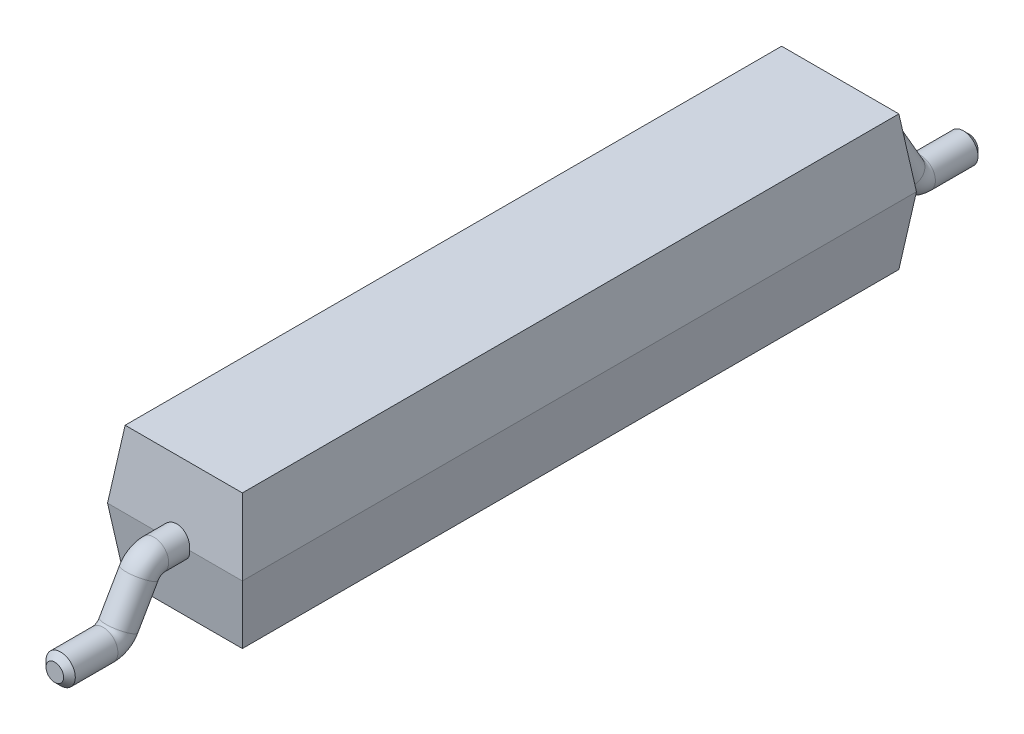
ISO-10303-21;
HEADER;
FILE_DESCRIPTION(('STEP AP214'),'2;1');
FILE_NAME('part.step','',(''),(''),'','','');
FILE_SCHEMA(('AUTOMOTIVE_DESIGN { 1 0 10303 214 1 1 1 1 }'));
ENDSEC;
DATA;
#1=APPLICATION_CONTEXT('core data for automotive mechanical design processes');
#2=APPLICATION_PROTOCOL_DEFINITION('international standard','automotive_design',2000,#1);
#3=PRODUCT_CONTEXT('',#1,'mechanical');
#4=PRODUCT('Part','Part','',(#3));
#5=PRODUCT_RELATED_PRODUCT_CATEGORY('part','',(#4));
#6=PRODUCT_DEFINITION_FORMATION('','',#4);
#7=PRODUCT_DEFINITION_CONTEXT('part definition',#1,'design');
#8=PRODUCT_DEFINITION('design','',#6,#7);
#9=PRODUCT_DEFINITION_SHAPE('','',#8);
#10=(LENGTH_UNIT() NAMED_UNIT(*) SI_UNIT(.MILLI.,.METRE.));
#11=(NAMED_UNIT(*) PLANE_ANGLE_UNIT() SI_UNIT($,.RADIAN.));
#12=(NAMED_UNIT(*) SI_UNIT($,.STERADIAN.) SOLID_ANGLE_UNIT());
#13=UNCERTAINTY_MEASURE_WITH_UNIT(LENGTH_MEASURE(1.E-05),#10,'distance_accuracy_value','');
#14=(GEOMETRIC_REPRESENTATION_CONTEXT(3) GLOBAL_UNCERTAINTY_ASSIGNED_CONTEXT((#13)) GLOBAL_UNIT_ASSIGNED_CONTEXT((#10,
#11,#12)) REPRESENTATION_CONTEXT('',''));
#15=CARTESIAN_POINT('',(0.,0.,0.));
#16=DIRECTION('',(0.,0.,1.));
#17=DIRECTION('',(1.,0.,0.));
#18=AXIS2_PLACEMENT_3D('',#15,#16,#17);
#19=CARTESIAN_POINT('',(-11.,1.15,5.75));
#20=DIRECTION('',(0.,-0.129339184067768,-0.991600411186222));
#21=DIRECTION('',(0.,0.991600411186222,-0.129339184067768));
#22=AXIS2_PLACEMENT_3D('',#19,#20,#21);
#23=PLANE('',#22);
#24=CARTESIAN_POINT('',(0.,1.15,5.75));
#25=DIRECTION('',(0.,-0.129339184067768,-0.991600411186222));
#26=DIRECTION('',(0.,0.991600411186222,-0.129339184067768));
#27=AXIS2_PLACEMENT_3D('',#24,#25,#26);
#28=ELLIPSE('',#27,0.252117684885722,0.25);
#29=CARTESIAN_POINT('',(0.249999999999995,1.15,5.75));
#30=VERTEX_POINT('',#29);
#31=CARTESIAN_POINT('',(-0.250000000000005,1.15,5.75));
#32=VERTEX_POINT('',#31);
#33=EDGE_CURVE('E238',#30,#32,#28,.F.);
#34=ORIENTED_EDGE('',*,*,#33,.F.);
#35=DIRECTION('',(1.,0.,0.));
#36=VECTOR('',#35,1.);
#37=CARTESIAN_POINT('',(-11.,1.15,5.75));
#38=LINE('',#37,#36);
#39=CARTESIAN_POINT('',(1.15,1.15,5.75));
#40=VERTEX_POINT('',#39);
#41=EDGE_CURVE('E237',#30,#40,#38,.T.);
#42=ORIENTED_EDGE('',*,*,#41,.T.);
#43=DIRECTION('',(0.128270737442704,-0.983408987060729,0.128270737442704));
#44=VECTOR('',#43,1.);
#45=CARTESIAN_POINT('',(1.15,1.15,5.75));
#46=LINE('',#45,#44);
#47=CARTESIAN_POINT('',(1.,2.3,5.6));
#48=VERTEX_POINT('',#47);
#49=EDGE_CURVE('E126',#48,#40,#46,.T.);
#50=ORIENTED_EDGE('',*,*,#49,.F.);
#51=DIRECTION('',(1.,0.,0.));
#52=VECTOR('',#51,1.);
#53=CARTESIAN_POINT('',(-11.,2.3,5.6));
#54=LINE('',#53,#52);
#55=CARTESIAN_POINT('',(-1.,2.3,5.6));
#56=VERTEX_POINT('',#55);
#57=EDGE_CURVE('E235',#56,#48,#54,.T.);
#58=ORIENTED_EDGE('',*,*,#57,.F.);
#59=DIRECTION('',(0.128270737442704,0.983408987060729,-0.128270737442704));
#60=VECTOR('',#59,1.);
#61=CARTESIAN_POINT('',(-1.00246800731261,2.28107861060329,5.60246800731261));
#62=LINE('',#61,#60);
#63=CARTESIAN_POINT('',(-1.15,1.15,5.75));
#64=VERTEX_POINT('',#63);
#65=EDGE_CURVE('E228',#64,#56,#62,.T.);
#66=ORIENTED_EDGE('',*,*,#65,.F.);
#67=EDGE_CURVE('E239',#64,#32,#38,.T.);
#68=ORIENTED_EDGE('',*,*,#67,.T.);
#69=EDGE_LOOP('',(#34,#42,#50,#58,#66,#68));
#70=FACE_BOUND('',#69,.T.);
#71=ADVANCED_FACE('F35',(#70),#23,.F.);
#72=CARTESIAN_POINT('',(-11.,0.,5.6));
#73=DIRECTION('',(0.,0.129339184067768,-0.991600411186222));
#74=DIRECTION('',(0.,0.991600411186222,0.129339184067768));
#75=AXIS2_PLACEMENT_3D('',#72,#73,#74);
#76=PLANE('',#75);
#77=CARTESIAN_POINT('',(0.,1.15,5.75));
#78=DIRECTION('',(0.,0.129339184067768,-0.991600411186222));
#79=DIRECTION('',(0.,-0.991600411186222,-0.129339184067768));
#80=AXIS2_PLACEMENT_3D('',#77,#78,#79);
#81=ELLIPSE('',#80,0.252117684885722,0.25);
#82=EDGE_CURVE('E57',#32,#30,#81,.F.);
#83=ORIENTED_EDGE('',*,*,#82,.F.);
#84=ORIENTED_EDGE('',*,*,#67,.F.);
#85=DIRECTION('',(-0.128270737442703,0.983408987060729,0.128270737442704));
#86=VECTOR('',#85,1.);
#87=CARTESIAN_POINT('',(-1.15,1.15,5.75));
#88=LINE('',#87,#86);
#89=CARTESIAN_POINT('',(-1.,0.,5.6));
#90=VERTEX_POINT('',#89);
#91=EDGE_CURVE('E217',#90,#64,#88,.T.);
#92=ORIENTED_EDGE('',*,*,#91,.F.);
#93=DIRECTION('',(1.,0.,0.));
#94=VECTOR('',#93,1.);
#95=CARTESIAN_POINT('',(-11.,0.,5.6));
#96=LINE('',#95,#94);
#97=CARTESIAN_POINT('',(1.,0.,5.6));
#98=VERTEX_POINT('',#97);
#99=EDGE_CURVE('E222',#90,#98,#96,.T.);
#100=ORIENTED_EDGE('',*,*,#99,.T.);
#101=DIRECTION('',(-0.128270737442703,-0.983408987060729,-0.128270737442704));
#102=VECTOR('',#101,1.);
#103=CARTESIAN_POINT('',(1.00246800731261,0.0189213893967095,5.60246800731261));
#104=LINE('',#103,#102);
#105=EDGE_CURVE('E231',#40,#98,#104,.T.);
#106=ORIENTED_EDGE('',*,*,#105,.F.);
#107=ORIENTED_EDGE('',*,*,#41,.F.);
#108=EDGE_LOOP('',(#83,#84,#92,#100,#106,#107));
#109=FACE_BOUND('',#108,.T.);
#110=ADVANCED_FACE('F173',(#109),#76,.F.);
#111=CARTESIAN_POINT('',(-1.15,1.15,5.75));
#112=DIRECTION('',(0.991600411186222,0.129339184067768,0.));
#113=DIRECTION('',(-0.129339184067768,0.991600411186222,0.));
#114=AXIS2_PLACEMENT_3D('',#111,#112,#113);
#115=PLANE('',#114);
#116=DIRECTION('',(0.,0.,-1.));
#117=VECTOR('',#116,1.);
#118=CARTESIAN_POINT('',(-1.,0.,5.75));
#119=LINE('',#118,#117);
#120=CARTESIAN_POINT('',(-1.,0.,-5.6));
#121=VERTEX_POINT('',#120);
#122=EDGE_CURVE('E151',#90,#121,#119,.T.);
#123=ORIENTED_EDGE('',*,*,#122,.F.);
#124=ORIENTED_EDGE('',*,*,#91,.T.);
#125=DIRECTION('',(0.,0.,-1.));
#126=VECTOR('',#125,1.);
#127=CARTESIAN_POINT('',(-1.15,1.15,5.75));
#128=LINE('',#127,#126);
#129=CARTESIAN_POINT('',(-1.15,1.15,-5.75));
#130=VERTEX_POINT('',#129);
#131=EDGE_CURVE('E139',#64,#130,#128,.T.);
#132=ORIENTED_EDGE('',*,*,#131,.T.);
#133=DIRECTION('',(0.128270737442703,-0.983408987060729,0.128270737442704));
#134=VECTOR('',#133,1.);
#135=CARTESIAN_POINT('',(-0.960786106032907,-0.300639853747715,-5.56078610603291));
#136=LINE('',#135,#134);
#137=EDGE_CURVE('E136',#130,#121,#136,.T.);
#138=ORIENTED_EDGE('',*,*,#137,.T.);
#139=EDGE_LOOP('',(#123,#124,#132,#138));
#140=FACE_BOUND('',#139,.T.);
#141=ADVANCED_FACE('F179',(#140),#115,.F.);
#142=CARTESIAN_POINT('',(-1.,0.,5.75));
#143=DIRECTION('',(0.,1.,0.));
#144=DIRECTION('',(0.,0.,1.));
#145=AXIS2_PLACEMENT_3D('',#142,#143,#144);
#146=PLANE('',#145);
#147=DIRECTION('',(0.,0.,-1.));
#148=VECTOR('',#147,1.);
#149=CARTESIAN_POINT('',(1.,0.,5.75));
#150=LINE('',#149,#148);
#151=CARTESIAN_POINT('',(1.,0.,-5.6));
#152=VERTEX_POINT('',#151);
#153=EDGE_CURVE('E149',#98,#152,#150,.T.);
#154=ORIENTED_EDGE('',*,*,#153,.F.);
#155=ORIENTED_EDGE('',*,*,#99,.F.);
#156=ORIENTED_EDGE('',*,*,#122,.T.);
#157=DIRECTION('',(1.,0.,0.));
#158=VECTOR('',#157,1.);
#159=CARTESIAN_POINT('',(-11.,0.,-5.6));
#160=LINE('',#159,#158);
#161=EDGE_CURVE('E123',#121,#152,#160,.T.);
#162=ORIENTED_EDGE('',*,*,#161,.T.);
#163=EDGE_LOOP('',(#154,#155,#156,#162));
#164=FACE_BOUND('',#163,.T.);
#165=ADVANCED_FACE('F206',(#164),#146,.F.);
#166=CARTESIAN_POINT('',(1.,0.,5.75));
#167=DIRECTION('',(-0.991600411186222,0.129339184067768,0.));
#168=DIRECTION('',(-0.129339184067768,-0.991600411186222,0.));
#169=AXIS2_PLACEMENT_3D('',#166,#167,#168);
#170=PLANE('',#169);
#171=DIRECTION('',(0.,0.,-1.));
#172=VECTOR('',#171,1.);
#173=CARTESIAN_POINT('',(1.15,1.15,5.75));
#174=LINE('',#173,#172);
#175=CARTESIAN_POINT('',(1.15,1.15,-5.75));
#176=VERTEX_POINT('',#175);
#177=EDGE_CURVE('E146',#40,#176,#174,.T.);
#178=ORIENTED_EDGE('',*,*,#177,.F.);
#179=ORIENTED_EDGE('',*,*,#105,.T.);
#180=ORIENTED_EDGE('',*,*,#153,.T.);
#181=DIRECTION('',(0.128270737442703,0.983408987060729,-0.128270737442704));
#182=VECTOR('',#181,1.);
#183=CARTESIAN_POINT('',(0.813254113345522,-1.43171846435101,-5.41325411334552));
#184=LINE('',#183,#182);
#185=EDGE_CURVE('E134',#152,#176,#184,.T.);
#186=ORIENTED_EDGE('',*,*,#185,.T.);
#187=EDGE_LOOP('',(#178,#179,#180,#186));
#188=FACE_BOUND('',#187,.T.);
#189=ADVANCED_FACE('F202',(#188),#170,.F.);
#190=CARTESIAN_POINT('',(1.15,1.15,5.75));
#191=DIRECTION('',(-0.991600411186222,-0.129339184067768,0.));
#192=DIRECTION('',(0.129339184067768,-0.991600411186222,0.));
#193=AXIS2_PLACEMENT_3D('',#190,#191,#192);
#194=PLANE('',#193);
#195=DIRECTION('',(0.,0.,-1.));
#196=VECTOR('',#195,1.);
#197=CARTESIAN_POINT('',(1.,2.3,5.75));
#198=LINE('',#197,#196);
#199=CARTESIAN_POINT('',(1.,2.3,-5.6));
#200=VERTEX_POINT('',#199);
#201=EDGE_CURVE('E144',#48,#200,#198,.T.);
#202=ORIENTED_EDGE('',*,*,#201,.F.);
#203=ORIENTED_EDGE('',*,*,#49,.T.);
#204=ORIENTED_EDGE('',*,*,#177,.T.);
#205=DIRECTION('',(-0.128270737442704,0.983408987060729,0.128270737442704));
#206=VECTOR('',#205,1.);
#207=CARTESIAN_POINT('',(0.960786106032906,2.60063985374772,-5.56078610603291));
#208=LINE('',#207,#206);
#209=EDGE_CURVE('E118',#176,#200,#208,.T.);
#210=ORIENTED_EDGE('',*,*,#209,.T.);
#211=EDGE_LOOP('',(#202,#203,#204,#210));
#212=FACE_BOUND('',#211,.T.);
#213=ADVANCED_FACE('F198',(#212),#194,.F.);
#214=CARTESIAN_POINT('',(1.,2.3,5.75));
#215=DIRECTION('',(0.,-1.,0.));
#216=DIRECTION('',(0.,0.,-1.));
#217=AXIS2_PLACEMENT_3D('',#214,#215,#216);
#218=PLANE('',#217);
#219=DIRECTION('',(0.,0.,-1.));
#220=VECTOR('',#219,1.);
#221=CARTESIAN_POINT('',(-1.,2.3,5.75));
#222=LINE('',#221,#220);
#223=CARTESIAN_POINT('',(-1.,2.3,-5.6));
#224=VERTEX_POINT('',#223);
#225=EDGE_CURVE('E142',#56,#224,#222,.T.);
#226=ORIENTED_EDGE('',*,*,#225,.F.);
#227=ORIENTED_EDGE('',*,*,#57,.T.);
#228=ORIENTED_EDGE('',*,*,#201,.T.);
#229=DIRECTION('',(1.,0.,0.));
#230=VECTOR('',#229,1.);
#231=CARTESIAN_POINT('',(-11.,2.3,-5.6));
#232=LINE('',#231,#230);
#233=EDGE_CURVE('E120',#224,#200,#232,.T.);
#234=ORIENTED_EDGE('',*,*,#233,.F.);
#235=EDGE_LOOP('',(#226,#227,#228,#234));
#236=FACE_BOUND('',#235,.T.);
#237=ADVANCED_FACE('F194',(#236),#218,.F.);
#238=CARTESIAN_POINT('',(-1.,2.3,5.75));
#239=DIRECTION('',(0.991600411186222,-0.129339184067768,0.));
#240=DIRECTION('',(0.129339184067768,0.991600411186222,0.));
#241=AXIS2_PLACEMENT_3D('',#238,#239,#240);
#242=PLANE('',#241);
#243=ORIENTED_EDGE('',*,*,#131,.F.);
#244=ORIENTED_EDGE('',*,*,#65,.T.);
#245=ORIENTED_EDGE('',*,*,#225,.T.);
#246=DIRECTION('',(-0.128270737442704,-0.983408987060729,-0.128270737442704));
#247=VECTOR('',#246,1.);
#248=CARTESIAN_POINT('',(-0.81325411334552,3.73171846435101,-5.41325411334552));
#249=LINE('',#248,#247);
#250=EDGE_CURVE('E122',#224,#130,#249,.T.);
#251=ORIENTED_EDGE('',*,*,#250,.T.);
#252=EDGE_LOOP('',(#243,#244,#245,#251));
#253=FACE_BOUND('',#252,.T.);
#254=ADVANCED_FACE('F191',(#253),#242,.F.);
#255=CARTESIAN_POINT('',(-11.,0.,-5.6));
#256=DIRECTION('',(0.,0.129339184067768,0.991600411186222));
#257=DIRECTION('',(0.,-0.991600411186222,0.129339184067768));
#258=AXIS2_PLACEMENT_3D('',#255,#256,#257);
#259=PLANE('',#258);
#260=DIRECTION('',(1.,0.,0.));
#261=VECTOR('',#260,1.);
#262=CARTESIAN_POINT('',(-11.,1.15,-5.75));
#263=LINE('',#262,#261);
#264=CARTESIAN_POINT('',(-0.25,1.15,-5.75));
#265=VERTEX_POINT('',#264);
#266=EDGE_CURVE('E111',#130,#265,#263,.T.);
#267=ORIENTED_EDGE('',*,*,#266,.T.);
#268=CARTESIAN_POINT('',(0.,1.15,-5.75));
#269=DIRECTION('',(0.,0.129339184067768,0.991600411186222));
#270=DIRECTION('',(0.,-0.991600411186222,0.129339184067768));
#271=AXIS2_PLACEMENT_3D('',#268,#269,#270);
#272=ELLIPSE('',#271,0.252117684885722,0.25);
#273=CARTESIAN_POINT('',(0.25,1.15,-5.75));
#274=VERTEX_POINT('',#273);
#275=EDGE_CURVE('E49',#265,#274,#272,.T.);
#276=ORIENTED_EDGE('',*,*,#275,.T.);
#277=EDGE_CURVE('E108',#274,#176,#263,.T.);
#278=ORIENTED_EDGE('',*,*,#277,.T.);
#279=ORIENTED_EDGE('',*,*,#185,.F.);
#280=ORIENTED_EDGE('',*,*,#161,.F.);
#281=ORIENTED_EDGE('',*,*,#137,.F.);
#282=EDGE_LOOP('',(#267,#276,#278,#279,#280,#281));
#283=FACE_BOUND('',#282,.T.);
#284=ADVANCED_FACE('F106',(#283),#259,.F.);
#285=CARTESIAN_POINT('',(-11.,1.15,-5.75));
#286=DIRECTION('',(0.,-0.129339184067768,0.991600411186222));
#287=DIRECTION('',(0.,-0.991600411186222,-0.129339184067768));
#288=AXIS2_PLACEMENT_3D('',#285,#286,#287);
#289=PLANE('',#288);
#290=ORIENTED_EDGE('',*,*,#277,.F.);
#291=CARTESIAN_POINT('',(0.,1.15,-5.75));
#292=DIRECTION('',(0.,-0.129339184067768,0.991600411186222));
#293=DIRECTION('',(0.,0.991600411186222,0.129339184067768));
#294=AXIS2_PLACEMENT_3D('',#291,#292,#293);
#295=ELLIPSE('',#294,0.252117684885722,0.25);
#296=EDGE_CURVE('E98',#274,#265,#295,.T.);
#297=ORIENTED_EDGE('',*,*,#296,.T.);
#298=ORIENTED_EDGE('',*,*,#266,.F.);
#299=ORIENTED_EDGE('',*,*,#250,.F.);
#300=ORIENTED_EDGE('',*,*,#233,.T.);
#301=ORIENTED_EDGE('',*,*,#209,.F.);
#302=EDGE_LOOP('',(#290,#297,#298,#299,#300,#301));
#303=FACE_BOUND('',#302,.T.);
#304=ADVANCED_FACE('F115',(#303),#289,.F.);
#305=CARTESIAN_POINT('',(0.,1.15,6.10717967697245));
#306=DIRECTION('',(0.,0.,-1.));
#307=DIRECTION('',(0.,1.,0.));
#308=AXIS2_PLACEMENT_3D('',#305,#306,#307);
#309=CYLINDRICAL_SURFACE('',#308,0.25);
#310=CARTESIAN_POINT('',(0.,1.15,6.10717967697245));
#311=DIRECTION('',(0.,0.,1.));
#312=DIRECTION('',(1.,0.,0.));
#313=AXIS2_PLACEMENT_3D('',#310,#311,#312);
#314=CIRCLE('',#313,0.25);
#315=CARTESIAN_POINT('',(0.,1.4,6.10717967697245));
#316=VERTEX_POINT('',#315);
#317=EDGE_CURVE('E112',#316,#316,#314,.T.);
#318=ORIENTED_EDGE('',*,*,#317,.F.);
#319=EDGE_LOOP('',(#318));
#320=FACE_BOUND('',#319,.T.);
#321=ORIENTED_EDGE('',*,*,#82,.T.);
#322=ORIENTED_EDGE('',*,*,#33,.T.);
#323=EDGE_LOOP('',(#321,#322));
#324=FACE_BOUND('',#323,.T.);
#325=ADVANCED_FACE('F188',(#320,#324),#309,.T.);
#326=CARTESIAN_POINT('',(0.,0.25,6.97320508075689));
#327=DIRECTION('',(0.,0.,1.));
#328=DIRECTION('',(0.,-1.,0.));
#329=AXIS2_PLACEMENT_3D('',#326,#327,#328);
#330=CYLINDRICAL_SURFACE('',#329,0.25);
#331=CARTESIAN_POINT('',(0.,0.25,7.7));
#332=DIRECTION('',(0.,0.,1.));
#333=DIRECTION('',(1.,0.,0.));
#334=AXIS2_PLACEMENT_3D('',#331,#332,#333);
#335=CIRCLE('',#334,0.25);
#336=CARTESIAN_POINT('',(0.25,0.25,7.7));
#337=VERTEX_POINT('',#336);
#338=EDGE_CURVE('E11',#337,#337,#335,.F.);
#339=ORIENTED_EDGE('',*,*,#338,.T.);
#340=EDGE_LOOP('',(#339));
#341=FACE_BOUND('',#340,.T.);
#342=CARTESIAN_POINT('',(0.,0.25,6.97320508075689));
#343=DIRECTION('',(0.,0.,1.));
#344=DIRECTION('',(1.,0.,0.));
#345=AXIS2_PLACEMENT_3D('',#342,#343,#344);
#346=CIRCLE('',#345,0.25);
#347=CARTESIAN_POINT('',(0.,0.,6.97320508075689));
#348=VERTEX_POINT('',#347);
#349=EDGE_CURVE('E244',#348,#348,#346,.T.);
#350=ORIENTED_EDGE('',*,*,#349,.T.);
#351=EDGE_LOOP('',(#350));
#352=FACE_BOUND('',#351,.T.);
#353=ADVANCED_FACE('F183',(#341,#352),#330,.T.);
#354=CARTESIAN_POINT('',(0.,0.549999999999999,6.97320508075689));
#355=DIRECTION('',(-1.,0.,0.));
#356=DIRECTION('',(0.,0.,1.));
#357=AXIS2_PLACEMENT_3D('',#354,#355,#356);
#358=TOROIDAL_SURFACE('',#357,0.3,0.25);
#359=CARTESIAN_POINT('',(0.,0.4,6.71339745962156));
#360=DIRECTION('',(0.,-0.866025403784441,0.499999999999995));
#361=DIRECTION('',(1.,0.,0.));
#362=AXIS2_PLACEMENT_3D('',#359,#360,#361);
#363=CIRCLE('',#362,0.25);
#364=CARTESIAN_POINT('',(0.,0.275,6.49689110867545));
#365=VERTEX_POINT('',#364);
#366=EDGE_CURVE('E247',#365,#365,#363,.T.);
#367=CARTESIAN_POINT('',(0.,0.549999999999999,6.97320508075689));
#368=DIRECTION('',(-1.,0.,0.));
#369=DIRECTION('',(0.,0.,1.));
#370=AXIS2_PLACEMENT_3D('',#367,#368,#369);
#371=CIRCLE('',#370,0.549999999999999);
#372=EDGE_CURVE('',#365,#348,#371,.T.);
#373=ORIENTED_EDGE('',*,*,#366,.T.);
#374=ORIENTED_EDGE('',*,*,#349,.F.);
#375=ORIENTED_EDGE('',*,*,#372,.T.);
#376=ORIENTED_EDGE('',*,*,#372,.F.);
#377=EDGE_LOOP('',(#373,#375,#374,#376));
#378=FACE_BOUND('',#377,.T.);
#379=ADVANCED_FACE('F306',(#378),#358,.T.);
#380=CARTESIAN_POINT('',(0.,1.,6.36698729810778));
#381=DIRECTION('',(0.,-0.866025403784441,0.499999999999996));
#382=DIRECTION('',(0.,-0.499999999999996,-0.866025403784441));
#383=AXIS2_PLACEMENT_3D('',#380,#381,#382);
#384=CYLINDRICAL_SURFACE('',#383,0.25);
#385=CARTESIAN_POINT('',(0.,1.,6.36698729810778));
#386=DIRECTION('',(0.,-0.866025403784441,0.499999999999995));
#387=DIRECTION('',(1.,0.,0.));
#388=AXIS2_PLACEMENT_3D('',#385,#386,#387);
#389=CIRCLE('',#388,0.25);
#390=CARTESIAN_POINT('',(0.,1.125,6.58349364905389));
#391=VERTEX_POINT('',#390);
#392=EDGE_CURVE('E250',#391,#391,#389,.T.);
#393=ORIENTED_EDGE('',*,*,#392,.T.);
#394=EDGE_LOOP('',(#393));
#395=FACE_BOUND('',#394,.T.);
#396=ORIENTED_EDGE('',*,*,#366,.F.);
#397=EDGE_LOOP('',(#396));
#398=FACE_BOUND('',#397,.T.);
#399=ADVANCED_FACE('F303',(#395,#398),#384,.T.);
#400=CARTESIAN_POINT('',(0.,0.85,6.10717967697245));
#401=DIRECTION('',(1.,0.,0.));
#402=DIRECTION('',(0.,0.,-1.));
#403=AXIS2_PLACEMENT_3D('',#400,#401,#402);
#404=TOROIDAL_SURFACE('',#403,0.3,0.25);
#405=CARTESIAN_POINT('',(0.,0.85,6.10717967697245));
#406=DIRECTION('',(1.,0.,0.));
#407=DIRECTION('',(0.,0.,-1.));
#408=AXIS2_PLACEMENT_3D('',#405,#406,#407);
#409=CIRCLE('',#408,0.55);
#410=EDGE_CURVE('',#316,#391,#409,.T.);
#411=ORIENTED_EDGE('',*,*,#317,.T.);
#412=ORIENTED_EDGE('',*,*,#392,.F.);
#413=ORIENTED_EDGE('',*,*,#410,.T.);
#414=ORIENTED_EDGE('',*,*,#410,.F.);
#415=EDGE_LOOP('',(#411,#413,#412,#414));
#416=FACE_BOUND('',#415,.T.);
#417=ADVANCED_FACE('F297',(#416),#404,.T.);
#418=CARTESIAN_POINT('',(0.,0.25,7.8));
#419=DIRECTION('',(0.,0.,1.));
#420=DIRECTION('',(1.,0.,0.));
#421=AXIS2_PLACEMENT_3D('',#418,#419,#420);
#422=PLANE('',#421);
#423=CARTESIAN_POINT('',(0.,0.25,7.8));
#424=DIRECTION('',(0.,0.,1.));
#425=DIRECTION('',(0.,-1.,0.));
#426=AXIS2_PLACEMENT_3D('',#423,#424,#425);
#427=CIRCLE('',#426,0.150000000000001);
#428=CARTESIAN_POINT('',(0.,0.0999999999999992,7.8));
#429=VERTEX_POINT('',#428);
#430=EDGE_CURVE('E43',#429,#429,#427,.T.);
#431=ORIENTED_EDGE('',*,*,#430,.T.);
#432=EDGE_LOOP('',(#431));
#433=FACE_BOUND('',#432,.T.);
#434=ADVANCED_FACE('F161',(#433),#422,.T.);
#435=CARTESIAN_POINT('',(0.,1.15,-6.10717967697245));
#436=DIRECTION('',(0.,0.,1.));
#437=DIRECTION('',(0.,-1.,0.));
#438=AXIS2_PLACEMENT_3D('',#435,#436,#437);
#439=CYLINDRICAL_SURFACE('',#438,0.25);
#440=CARTESIAN_POINT('',(0.,1.15,-6.10717967697245));
#441=DIRECTION('',(0.,0.,1.));
#442=DIRECTION('',(1.,0.,0.));
#443=AXIS2_PLACEMENT_3D('',#440,#441,#442);
#444=CIRCLE('',#443,0.25);
#445=CARTESIAN_POINT('',(0.,1.4,-6.10717967697245));
#446=VERTEX_POINT('',#445);
#447=EDGE_CURVE('E263',#446,#446,#444,.T.);
#448=ORIENTED_EDGE('',*,*,#447,.T.);
#449=EDGE_LOOP('',(#448));
#450=FACE_BOUND('',#449,.T.);
#451=ORIENTED_EDGE('',*,*,#275,.F.);
#452=ORIENTED_EDGE('',*,*,#296,.F.);
#453=EDGE_LOOP('',(#451,#452));
#454=FACE_BOUND('',#453,.T.);
#455=ADVANCED_FACE('F99',(#450,#454),#439,.T.);
#456=CARTESIAN_POINT('',(0.,0.25,-6.97320508075689));
#457=DIRECTION('',(0.,0.,-1.));
#458=DIRECTION('',(0.,1.,0.));
#459=AXIS2_PLACEMENT_3D('',#456,#457,#458);
#460=CYLINDRICAL_SURFACE('',#459,0.25);
#461=CARTESIAN_POINT('',(0.,0.25,-7.7));
#462=DIRECTION('',(0.,0.,-1.));
#463=DIRECTION('',(-1.,0.,0.));
#464=AXIS2_PLACEMENT_3D('',#461,#462,#463);
#465=CIRCLE('',#464,0.25);
#466=CARTESIAN_POINT('',(-0.25,0.25,-7.7));
#467=VERTEX_POINT('',#466);
#468=EDGE_CURVE('E103',#467,#467,#465,.F.);
#469=ORIENTED_EDGE('',*,*,#468,.T.);
#470=EDGE_LOOP('',(#469));
#471=FACE_BOUND('',#470,.T.);
#472=CARTESIAN_POINT('',(0.,0.25,-6.97320508075689));
#473=DIRECTION('',(0.,0.,1.));
#474=DIRECTION('',(1.,0.,0.));
#475=AXIS2_PLACEMENT_3D('',#472,#473,#474);
#476=CIRCLE('',#475,0.25);
#477=CARTESIAN_POINT('',(0.,0.,-6.97320508075689));
#478=VERTEX_POINT('',#477);
#479=EDGE_CURVE('E113',#478,#478,#476,.T.);
#480=ORIENTED_EDGE('',*,*,#479,.F.);
#481=EDGE_LOOP('',(#480));
#482=FACE_BOUND('',#481,.T.);
#483=ADVANCED_FACE('F283',(#471,#482),#460,.T.);
#484=CARTESIAN_POINT('',(0.,0.549999999999999,-6.97320508075689));
#485=DIRECTION('',(1.,0.,0.));
#486=DIRECTION('',(0.,0.,-1.));
#487=AXIS2_PLACEMENT_3D('',#484,#485,#486);
#488=TOROIDAL_SURFACE('',#487,0.3,0.25);
#489=CARTESIAN_POINT('',(0.,0.4,-6.71339745962156));
#490=DIRECTION('',(0.,0.866025403784441,0.499999999999995));
#491=DIRECTION('',(1.,0.,0.));
#492=AXIS2_PLACEMENT_3D('',#489,#490,#491);
#493=CIRCLE('',#492,0.25);
#494=CARTESIAN_POINT('',(0.,0.275,-6.49689110867545));
#495=VERTEX_POINT('',#494);
#496=EDGE_CURVE('E257',#495,#495,#493,.T.);
#497=CARTESIAN_POINT('',(0.,0.549999999999999,-6.97320508075689));
#498=DIRECTION('',(1.,0.,0.));
#499=DIRECTION('',(0.,0.,-1.));
#500=AXIS2_PLACEMENT_3D('',#497,#498,#499);
#501=CIRCLE('',#500,0.549999999999999);
#502=EDGE_CURVE('',#495,#478,#501,.T.);
#503=ORIENTED_EDGE('',*,*,#496,.F.);
#504=ORIENTED_EDGE('',*,*,#479,.T.);
#505=ORIENTED_EDGE('',*,*,#502,.T.);
#506=ORIENTED_EDGE('',*,*,#502,.F.);
#507=EDGE_LOOP('',(#503,#505,#504,#506));
#508=FACE_BOUND('',#507,.T.);
#509=ADVANCED_FACE('F277',(#508),#488,.T.);
#510=CARTESIAN_POINT('',(0.,1.,-6.36698729810778));
#511=DIRECTION('',(0.,-0.866025403784441,-0.499999999999996));
#512=DIRECTION('',(0.,0.499999999999996,-0.866025403784441));
#513=AXIS2_PLACEMENT_3D('',#510,#511,#512);
#514=CYLINDRICAL_SURFACE('',#513,0.25);
#515=CARTESIAN_POINT('',(0.,1.,-6.36698729810778));
#516=DIRECTION('',(0.,0.866025403784441,0.499999999999995));
#517=DIRECTION('',(1.,0.,0.));
#518=AXIS2_PLACEMENT_3D('',#515,#516,#517);
#519=CIRCLE('',#518,0.25);
#520=CARTESIAN_POINT('',(0.,1.125,-6.58349364905389));
#521=VERTEX_POINT('',#520);
#522=EDGE_CURVE('E260',#521,#521,#519,.T.);
#523=ORIENTED_EDGE('',*,*,#522,.F.);
#524=EDGE_LOOP('',(#523));
#525=FACE_BOUND('',#524,.T.);
#526=ORIENTED_EDGE('',*,*,#496,.T.);
#527=EDGE_LOOP('',(#526));
#528=FACE_BOUND('',#527,.T.);
#529=ADVANCED_FACE('F271',(#525,#528),#514,.T.);
#530=CARTESIAN_POINT('',(0.,0.85,-6.10717967697245));
#531=DIRECTION('',(-1.,0.,0.));
#532=DIRECTION('',(0.,0.,1.));
#533=AXIS2_PLACEMENT_3D('',#530,#531,#532);
#534=TOROIDAL_SURFACE('',#533,0.3,0.25);
#535=CARTESIAN_POINT('',(0.,0.85,-6.10717967697245));
#536=DIRECTION('',(-1.,0.,0.));
#537=DIRECTION('',(0.,0.,1.));
#538=AXIS2_PLACEMENT_3D('',#535,#536,#537);
#539=CIRCLE('',#538,0.55);
#540=EDGE_CURVE('',#446,#521,#539,.T.);
#541=ORIENTED_EDGE('',*,*,#447,.F.);
#542=ORIENTED_EDGE('',*,*,#522,.T.);
#543=ORIENTED_EDGE('',*,*,#540,.T.);
#544=ORIENTED_EDGE('',*,*,#540,.F.);
#545=EDGE_LOOP('',(#541,#543,#542,#544));
#546=FACE_BOUND('',#545,.T.);
#547=ADVANCED_FACE('F268',(#546),#534,.T.);
#548=CARTESIAN_POINT('',(0.,0.25,-7.8));
#549=DIRECTION('',(0.,0.,-1.));
#550=DIRECTION('',(1.,0.,0.));
#551=AXIS2_PLACEMENT_3D('',#548,#549,#550);
#552=PLANE('',#551);
#553=CARTESIAN_POINT('',(0.,0.25,-7.8));
#554=DIRECTION('',(0.,0.,-1.));
#555=DIRECTION('',(0.,1.,0.));
#556=AXIS2_PLACEMENT_3D('',#553,#554,#555);
#557=CIRCLE('',#556,0.149999999999998);
#558=CARTESIAN_POINT('',(0.,0.399999999999998,-7.8));
#559=VERTEX_POINT('',#558);
#560=EDGE_CURVE('E156',#559,#559,#557,.T.);
#561=ORIENTED_EDGE('',*,*,#560,.T.);
#562=EDGE_LOOP('',(#561));
#563=FACE_BOUND('',#562,.T.);
#564=ADVANCED_FACE('F169',(#563),#552,.T.);
#565=CARTESIAN_POINT('',(0.,0.25,-7.7));
#566=DIRECTION('',(0.,0.,1.));
#567=DIRECTION('',(1.,0.,0.));
#568=AXIS2_PLACEMENT_3D('',#565,#566,#567);
#569=CONICAL_SURFACE('',#568,0.25,0.785398163397454);
#570=ORIENTED_EDGE('',*,*,#560,.F.);
#571=EDGE_LOOP('',(#570));
#572=FACE_BOUND('',#571,.T.);
#573=ORIENTED_EDGE('',*,*,#468,.F.);
#574=EDGE_LOOP('',(#573));
#575=FACE_BOUND('',#574,.T.);
#576=ADVANCED_FACE('F164',(#572,#575),#569,.T.);
#577=CARTESIAN_POINT('',(0.,0.25,7.8));
#578=DIRECTION('',(0.,0.,-1.));
#579=DIRECTION('',(-1.,0.,0.));
#580=AXIS2_PLACEMENT_3D('',#577,#578,#579);
#581=CONICAL_SURFACE('',#580,0.150000000000001,0.78539816339745);
#582=ORIENTED_EDGE('',*,*,#338,.F.);
#583=EDGE_LOOP('',(#582));
#584=FACE_BOUND('',#583,.T.);
#585=ORIENTED_EDGE('',*,*,#430,.F.);
#586=EDGE_LOOP('',(#585));
#587=FACE_BOUND('',#586,.T.);
#588=ADVANCED_FACE('F37',(#584,#587),#581,.T.);
#589=CLOSED_SHELL('',(#71,#110,#141,#165,#189,#213,#237,#254,#284,#304,#325,#353,#379,#399,#417,
#434,#455,#483,#509,#529,#547,#564,#576,#588));
#590=MANIFOLD_SOLID_BREP('B2',#589);
#591=ADVANCED_BREP_SHAPE_REPRESENTATION('',(#18,#590),#14);
#592=SHAPE_DEFINITION_REPRESENTATION(#9,#591);
ENDSEC;
END-ISO-10303-21;
